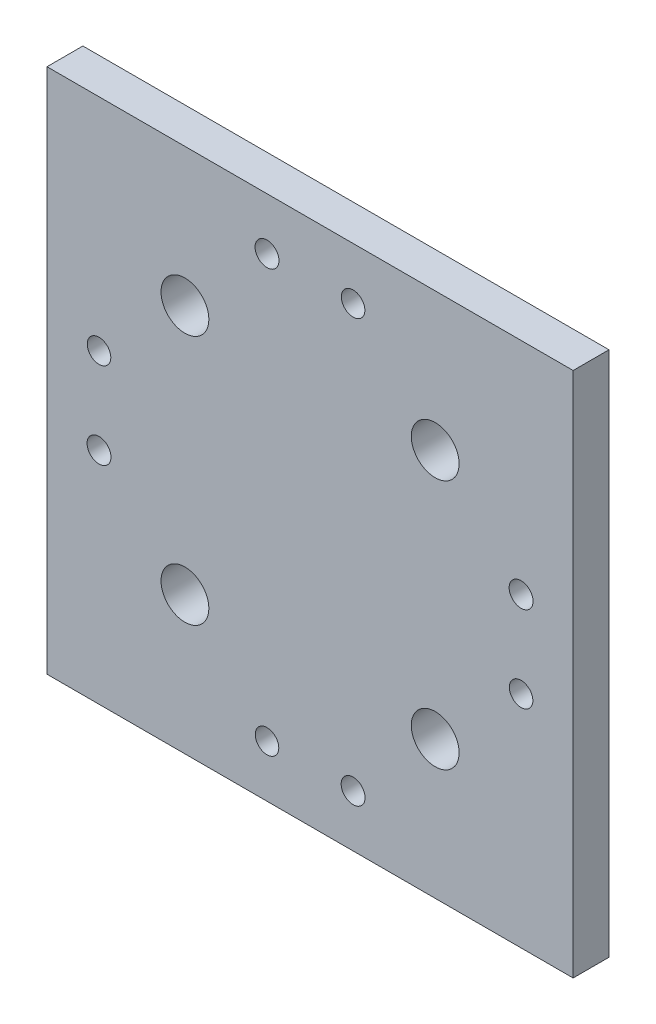
ISO-10303-21;
HEADER;
FILE_DESCRIPTION(('STEP AP214'),'2;1');
FILE_NAME('part.step','',(''),(''),'','','');
FILE_SCHEMA(('AUTOMOTIVE_DESIGN { 1 0 10303 214 1 1 1 1 }'));
ENDSEC;
DATA;
#1=APPLICATION_CONTEXT('core data for automotive mechanical design processes');
#2=APPLICATION_PROTOCOL_DEFINITION('international standard','automotive_design',2000,#1);
#3=PRODUCT_CONTEXT('',#1,'mechanical');
#4=PRODUCT('Part','Part','',(#3));
#5=PRODUCT_RELATED_PRODUCT_CATEGORY('part','',(#4));
#6=PRODUCT_DEFINITION_FORMATION('','',#4);
#7=PRODUCT_DEFINITION_CONTEXT('part definition',#1,'design');
#8=PRODUCT_DEFINITION('design','',#6,#7);
#9=PRODUCT_DEFINITION_SHAPE('','',#8);
#10=(LENGTH_UNIT() NAMED_UNIT(*) SI_UNIT(.MILLI.,.METRE.));
#11=(NAMED_UNIT(*) PLANE_ANGLE_UNIT() SI_UNIT($,.RADIAN.));
#12=(NAMED_UNIT(*) SI_UNIT($,.STERADIAN.) SOLID_ANGLE_UNIT());
#13=UNCERTAINTY_MEASURE_WITH_UNIT(LENGTH_MEASURE(1.E-05),#10,'distance_accuracy_value','');
#14=(GEOMETRIC_REPRESENTATION_CONTEXT(3) GLOBAL_UNCERTAINTY_ASSIGNED_CONTEXT((#13)) GLOBAL_UNIT_ASSIGNED_CONTEXT((#10,
#11,#12)) REPRESENTATION_CONTEXT('',''));
#15=CARTESIAN_POINT('',(0.,0.,0.));
#16=DIRECTION('',(0.,0.,1.));
#17=DIRECTION('',(1.,0.,0.));
#18=AXIS2_PLACEMENT_3D('',#15,#16,#17);
#19=CARTESIAN_POINT('',(69.85,69.85,0.));
#20=DIRECTION('',(0.,0.,-1.));
#21=DIRECTION('',(-1.,0.,0.));
#22=AXIS2_PLACEMENT_3D('',#19,#20,#21);
#23=PLANE('',#22);
#24=CARTESIAN_POINT('',(-11.4300000000006,56.0323999999999,0.));
#25=DIRECTION('',(0.,0.,-1.));
#26=DIRECTION('',(-1.,0.,0.));
#27=AXIS2_PLACEMENT_3D('',#24,#25,#26);
#28=CIRCLE('',#27,3.17499999999999);
#29=CARTESIAN_POINT('',(-14.6050000000006,56.0323999999999,0.));
#30=VERTEX_POINT('',#29);
#31=EDGE_CURVE('E195',#30,#30,#28,.T.);
#32=ORIENTED_EDGE('',*,*,#31,.F.);
#33=EDGE_LOOP('',(#32));
#34=FACE_BOUND('',#33,.T.);
#35=CARTESIAN_POINT('',(56.0323999999999,11.4300000000004,0.));
#36=DIRECTION('',(0.,0.,-1.));
#37=DIRECTION('',(-1.,0.,0.));
#38=AXIS2_PLACEMENT_3D('',#35,#36,#37);
#39=CIRCLE('',#38,3.17499999999999);
#40=CARTESIAN_POINT('',(52.8573999999999,11.4300000000004,0.));
#41=VERTEX_POINT('',#40);
#42=EDGE_CURVE('E189',#41,#41,#39,.T.);
#43=ORIENTED_EDGE('',*,*,#42,.F.);
#44=EDGE_LOOP('',(#43));
#45=FACE_BOUND('',#44,.T.);
#46=CARTESIAN_POINT('',(11.4300000000002,-56.0324,0.));
#47=DIRECTION('',(0.,0.,-1.));
#48=DIRECTION('',(-1.,0.,0.));
#49=AXIS2_PLACEMENT_3D('',#46,#47,#48);
#50=CIRCLE('',#49,3.17499999999999);
#51=CARTESIAN_POINT('',(8.25500000000021,-56.0324,0.));
#52=VERTEX_POINT('',#51);
#53=EDGE_CURVE('E183',#52,#52,#50,.T.);
#54=ORIENTED_EDGE('',*,*,#53,.F.);
#55=EDGE_LOOP('',(#54));
#56=FACE_BOUND('',#55,.T.);
#57=CARTESIAN_POINT('',(11.4299999999994,56.0324000000001,0.));
#58=DIRECTION('',(0.,0.,-1.));
#59=DIRECTION('',(-1.,0.,0.));
#60=AXIS2_PLACEMENT_3D('',#57,#58,#59);
#61=CIRCLE('',#60,3.12419999999999);
#62=CARTESIAN_POINT('',(8.30579999999941,56.0324000000001,0.));
#63=VERTEX_POINT('',#62);
#64=EDGE_CURVE('E177',#63,#63,#61,.T.);
#65=ORIENTED_EDGE('',*,*,#64,.F.);
#66=EDGE_LOOP('',(#65));
#67=FACE_BOUND('',#66,.T.);
#68=CARTESIAN_POINT('',(56.0324000000001,-11.4299999999996,0.));
#69=DIRECTION('',(0.,0.,-1.));
#70=DIRECTION('',(-1.,0.,0.));
#71=AXIS2_PLACEMENT_3D('',#68,#69,#70);
#72=CIRCLE('',#71,3.12419999999999);
#73=CARTESIAN_POINT('',(52.9082000000001,-11.4299999999996,0.));
#74=VERTEX_POINT('',#73);
#75=EDGE_CURVE('E171',#74,#74,#72,.T.);
#76=ORIENTED_EDGE('',*,*,#75,.F.);
#77=EDGE_LOOP('',(#76));
#78=FACE_BOUND('',#77,.T.);
#79=CARTESIAN_POINT('',(-11.4299999999998,-56.0324,0.));
#80=DIRECTION('',(0.,0.,-1.));
#81=DIRECTION('',(-1.,0.,0.));
#82=AXIS2_PLACEMENT_3D('',#79,#80,#81);
#83=CIRCLE('',#82,3.12419999999999);
#84=CARTESIAN_POINT('',(-14.5541999999998,-56.0324,0.));
#85=VERTEX_POINT('',#84);
#86=EDGE_CURVE('E165',#85,#85,#83,.T.);
#87=ORIENTED_EDGE('',*,*,#86,.F.);
#88=EDGE_LOOP('',(#87));
#89=FACE_BOUND('',#88,.T.);
#90=DIRECTION('',(0.,1.,0.));
#91=VECTOR('',#90,1.);
#92=CARTESIAN_POINT('',(69.85,-69.85,0.));
#93=LINE('',#92,#91);
#94=CARTESIAN_POINT('',(69.85,-69.85,0.));
#95=VERTEX_POINT('',#94);
#96=CARTESIAN_POINT('',(69.85,69.85,0.));
#97=VERTEX_POINT('',#96);
#98=EDGE_CURVE('E100',#95,#97,#93,.T.);
#99=ORIENTED_EDGE('',*,*,#98,.F.);
#100=DIRECTION('',(1.,0.,0.));
#101=VECTOR('',#100,1.);
#102=CARTESIAN_POINT('',(-69.85,-69.85,0.));
#103=LINE('',#102,#101);
#104=CARTESIAN_POINT('',(-69.85,-69.85,0.));
#105=VERTEX_POINT('',#104);
#106=EDGE_CURVE('E74',#105,#95,#103,.T.);
#107=ORIENTED_EDGE('',*,*,#106,.F.);
#108=DIRECTION('',(0.,-1.,0.));
#109=VECTOR('',#108,1.);
#110=CARTESIAN_POINT('',(-69.85,-69.85,0.));
#111=LINE('',#110,#109);
#112=CARTESIAN_POINT('',(-69.85,69.85,0.));
#113=VERTEX_POINT('',#112);
#114=EDGE_CURVE('E68',#113,#105,#111,.T.);
#115=ORIENTED_EDGE('',*,*,#114,.F.);
#116=DIRECTION('',(-1.,0.,0.));
#117=VECTOR('',#116,1.);
#118=CARTESIAN_POINT('',(-69.85,69.85,0.));
#119=LINE('',#118,#117);
#120=EDGE_CURVE('E91',#97,#113,#119,.T.);
#121=ORIENTED_EDGE('',*,*,#120,.F.);
#122=EDGE_LOOP('',(#99,#107,#115,#121));
#123=FACE_BOUND('',#122,.T.);
#124=CARTESIAN_POINT('',(-33.2269476479559,33.2269476479559,0.));
#125=DIRECTION('',(0.,0.,1.));
#126=DIRECTION('',(1.,0.,0.));
#127=AXIS2_PLACEMENT_3D('',#124,#125,#126);
#128=CIRCLE('',#127,6.34999999999999);
#129=CARTESIAN_POINT('',(-26.8769476479559,33.2269476479559,0.));
#130=VERTEX_POINT('',#129);
#131=EDGE_CURVE('E103',#130,#130,#128,.T.);
#132=ORIENTED_EDGE('',*,*,#131,.T.);
#133=EDGE_LOOP('',(#132));
#134=FACE_BOUND('',#133,.T.);
#135=CARTESIAN_POINT('',(-56.0324,11.43,0.));
#136=DIRECTION('',(0.,0.,-1.));
#137=DIRECTION('',(-1.,0.,0.));
#138=AXIS2_PLACEMENT_3D('',#135,#136,#137);
#139=CIRCLE('',#138,3.12419999999999);
#140=CARTESIAN_POINT('',(-59.1566,11.43,0.));
#141=VERTEX_POINT('',#140);
#142=EDGE_CURVE('E108',#141,#141,#139,.T.);
#143=ORIENTED_EDGE('',*,*,#142,.F.);
#144=EDGE_LOOP('',(#143));
#145=FACE_BOUND('',#144,.T.);
#146=CARTESIAN_POINT('',(-56.0324,-11.43,0.));
#147=DIRECTION('',(0.,0.,-1.));
#148=DIRECTION('',(-1.,0.,0.));
#149=AXIS2_PLACEMENT_3D('',#146,#147,#148);
#150=CIRCLE('',#149,3.17499999999999);
#151=CARTESIAN_POINT('',(-59.2074,-11.43,0.));
#152=VERTEX_POINT('',#151);
#153=EDGE_CURVE('E36',#152,#152,#150,.T.);
#154=ORIENTED_EDGE('',*,*,#153,.F.);
#155=EDGE_LOOP('',(#154));
#156=FACE_BOUND('',#155,.T.);
#157=CARTESIAN_POINT('',(-33.2269476479558,-33.226947647956,0.));
#158=DIRECTION('',(0.,0.,1.));
#159=DIRECTION('',(1.,0.,0.));
#160=AXIS2_PLACEMENT_3D('',#157,#158,#159);
#161=CIRCLE('',#160,6.34999999999999);
#162=CARTESIAN_POINT('',(-26.8769476479558,-33.226947647956,0.));
#163=VERTEX_POINT('',#162);
#164=EDGE_CURVE('E149',#163,#163,#161,.T.);
#165=ORIENTED_EDGE('',*,*,#164,.T.);
#166=EDGE_LOOP('',(#165));
#167=FACE_BOUND('',#166,.T.);
#168=CARTESIAN_POINT('',(33.2269476479561,-33.2269476479556,0.));
#169=DIRECTION('',(0.,0.,1.));
#170=DIRECTION('',(1.,0.,0.));
#171=AXIS2_PLACEMENT_3D('',#168,#169,#170);
#172=CIRCLE('',#171,6.34999999999999);
#173=CARTESIAN_POINT('',(39.5769476479561,-33.2269476479556,0.));
#174=VERTEX_POINT('',#173);
#175=EDGE_CURVE('E150',#174,#174,#172,.T.);
#176=ORIENTED_EDGE('',*,*,#175,.T.);
#177=EDGE_LOOP('',(#176));
#178=FACE_BOUND('',#177,.T.);
#179=CARTESIAN_POINT('',(33.2269476479555,33.2269476479562,0.));
#180=DIRECTION('',(0.,0.,1.));
#181=DIRECTION('',(1.,0.,0.));
#182=AXIS2_PLACEMENT_3D('',#179,#180,#181);
#183=CIRCLE('',#182,6.34999999999999);
#184=CARTESIAN_POINT('',(39.5769476479555,33.2269476479562,0.));
#185=VERTEX_POINT('',#184);
#186=EDGE_CURVE('E159',#185,#185,#183,.T.);
#187=ORIENTED_EDGE('',*,*,#186,.T.);
#188=EDGE_LOOP('',(#187));
#189=FACE_BOUND('',#188,.T.);
#190=ADVANCED_FACE('F32',(#34,#45,#56,#67,#78,#89,#123,#134,#145,#156,#167,#178,#189),#23,.T.);
#191=CARTESIAN_POINT('',(69.85,69.85,9.525));
#192=DIRECTION('',(0.,0.,-1.));
#193=DIRECTION('',(-1.,0.,0.));
#194=AXIS2_PLACEMENT_3D('',#191,#192,#193);
#195=PLANE('',#194);
#196=CARTESIAN_POINT('',(-11.4300000000006,56.0323999999999,9.525));
#197=DIRECTION('',(0.,0.,1.));
#198=DIRECTION('',(1.,0.,0.));
#199=AXIS2_PLACEMENT_3D('',#196,#197,#198);
#200=CIRCLE('',#199,3.175);
#201=CARTESIAN_POINT('',(-8.2550000000006,56.0323999999999,9.525));
#202=VERTEX_POINT('',#201);
#203=EDGE_CURVE('E198',#202,#202,#200,.T.);
#204=ORIENTED_EDGE('',*,*,#203,.F.);
#205=EDGE_LOOP('',(#204));
#206=FACE_BOUND('',#205,.T.);
#207=CARTESIAN_POINT('',(56.0323999999999,11.4300000000004,9.525));
#208=DIRECTION('',(0.,0.,1.));
#209=DIRECTION('',(1.,0.,0.));
#210=AXIS2_PLACEMENT_3D('',#207,#208,#209);
#211=CIRCLE('',#210,3.175);
#212=CARTESIAN_POINT('',(59.2073999999999,11.4300000000004,9.525));
#213=VERTEX_POINT('',#212);
#214=EDGE_CURVE('E192',#213,#213,#211,.T.);
#215=ORIENTED_EDGE('',*,*,#214,.F.);
#216=EDGE_LOOP('',(#215));
#217=FACE_BOUND('',#216,.T.);
#218=CARTESIAN_POINT('',(11.4300000000002,-56.0324,9.525));
#219=DIRECTION('',(0.,0.,1.));
#220=DIRECTION('',(1.,0.,0.));
#221=AXIS2_PLACEMENT_3D('',#218,#219,#220);
#222=CIRCLE('',#221,3.175);
#223=CARTESIAN_POINT('',(14.6050000000002,-56.0324,9.525));
#224=VERTEX_POINT('',#223);
#225=EDGE_CURVE('E186',#224,#224,#222,.T.);
#226=ORIENTED_EDGE('',*,*,#225,.F.);
#227=EDGE_LOOP('',(#226));
#228=FACE_BOUND('',#227,.T.);
#229=CARTESIAN_POINT('',(11.4299999999994,56.0324000000001,9.525));
#230=DIRECTION('',(0.,0.,1.));
#231=DIRECTION('',(1.,0.,0.));
#232=AXIS2_PLACEMENT_3D('',#229,#230,#231);
#233=CIRCLE('',#232,3.1242);
#234=CARTESIAN_POINT('',(14.5541999999994,56.0324000000001,9.525));
#235=VERTEX_POINT('',#234);
#236=EDGE_CURVE('E180',#235,#235,#233,.T.);
#237=ORIENTED_EDGE('',*,*,#236,.F.);
#238=EDGE_LOOP('',(#237));
#239=FACE_BOUND('',#238,.T.);
#240=CARTESIAN_POINT('',(56.0324000000001,-11.4299999999996,9.525));
#241=DIRECTION('',(0.,0.,1.));
#242=DIRECTION('',(1.,0.,0.));
#243=AXIS2_PLACEMENT_3D('',#240,#241,#242);
#244=CIRCLE('',#243,3.12419999999999);
#245=CARTESIAN_POINT('',(59.1566000000001,-11.4299999999996,9.525));
#246=VERTEX_POINT('',#245);
#247=EDGE_CURVE('E174',#246,#246,#244,.T.);
#248=ORIENTED_EDGE('',*,*,#247,.F.);
#249=EDGE_LOOP('',(#248));
#250=FACE_BOUND('',#249,.T.);
#251=CARTESIAN_POINT('',(-11.4299999999998,-56.0324,9.525));
#252=DIRECTION('',(0.,0.,1.));
#253=DIRECTION('',(1.,0.,0.));
#254=AXIS2_PLACEMENT_3D('',#251,#252,#253);
#255=CIRCLE('',#254,3.1242);
#256=CARTESIAN_POINT('',(-8.3057999999998,-56.0324,9.525));
#257=VERTEX_POINT('',#256);
#258=EDGE_CURVE('E168',#257,#257,#255,.T.);
#259=ORIENTED_EDGE('',*,*,#258,.F.);
#260=EDGE_LOOP('',(#259));
#261=FACE_BOUND('',#260,.T.);
#262=CARTESIAN_POINT('',(33.2269476479555,33.2269476479562,9.525));
#263=DIRECTION('',(0.,0.,1.));
#264=DIRECTION('',(1.,0.,0.));
#265=AXIS2_PLACEMENT_3D('',#262,#263,#264);
#266=CIRCLE('',#265,6.34999999999999);
#267=CARTESIAN_POINT('',(39.5769476479555,33.2269476479562,9.525));
#268=VERTEX_POINT('',#267);
#269=EDGE_CURVE('E162',#268,#268,#266,.T.);
#270=ORIENTED_EDGE('',*,*,#269,.F.);
#271=EDGE_LOOP('',(#270));
#272=FACE_BOUND('',#271,.T.);
#273=CARTESIAN_POINT('',(33.2269476479561,-33.2269476479556,9.525));
#274=DIRECTION('',(0.,0.,1.));
#275=DIRECTION('',(1.,0.,0.));
#276=AXIS2_PLACEMENT_3D('',#273,#274,#275);
#277=CIRCLE('',#276,6.34999999999999);
#278=CARTESIAN_POINT('',(39.5769476479561,-33.2269476479556,9.525));
#279=VERTEX_POINT('',#278);
#280=EDGE_CURVE('E154',#279,#279,#277,.T.);
#281=ORIENTED_EDGE('',*,*,#280,.F.);
#282=EDGE_LOOP('',(#281));
#283=FACE_BOUND('',#282,.T.);
#284=DIRECTION('',(0.,1.,0.));
#285=VECTOR('',#284,1.);
#286=CARTESIAN_POINT('',(69.85,-69.85,9.525));
#287=LINE('',#286,#285);
#288=CARTESIAN_POINT('',(69.85,-69.85,9.525));
#289=VERTEX_POINT('',#288);
#290=CARTESIAN_POINT('',(69.85,69.85,9.525));
#291=VERTEX_POINT('',#290);
#292=EDGE_CURVE('E87',#289,#291,#287,.T.);
#293=ORIENTED_EDGE('',*,*,#292,.T.);
#294=DIRECTION('',(-1.,0.,0.));
#295=VECTOR('',#294,1.);
#296=CARTESIAN_POINT('',(-69.85,69.85,9.525));
#297=LINE('',#296,#295);
#298=CARTESIAN_POINT('',(-69.85,69.85,9.525));
#299=VERTEX_POINT('',#298);
#300=EDGE_CURVE('E81',#291,#299,#297,.T.);
#301=ORIENTED_EDGE('',*,*,#300,.T.);
#302=DIRECTION('',(0.,-1.,0.));
#303=VECTOR('',#302,1.);
#304=CARTESIAN_POINT('',(-69.85,-69.85,9.525));
#305=LINE('',#304,#303);
#306=CARTESIAN_POINT('',(-69.85,-69.85,9.525));
#307=VERTEX_POINT('',#306);
#308=EDGE_CURVE('E85',#299,#307,#305,.T.);
#309=ORIENTED_EDGE('',*,*,#308,.T.);
#310=DIRECTION('',(1.,0.,0.));
#311=VECTOR('',#310,1.);
#312=CARTESIAN_POINT('',(-69.85,-69.85,9.525));
#313=LINE('',#312,#311);
#314=EDGE_CURVE('E51',#307,#289,#313,.T.);
#315=ORIENTED_EDGE('',*,*,#314,.T.);
#316=EDGE_LOOP('',(#293,#301,#309,#315));
#317=FACE_BOUND('',#316,.T.);
#318=CARTESIAN_POINT('',(-33.2269476479559,33.2269476479559,9.525));
#319=DIRECTION('',(0.,0.,1.));
#320=DIRECTION('',(1.,0.,0.));
#321=AXIS2_PLACEMENT_3D('',#318,#319,#320);
#322=CIRCLE('',#321,6.34999999999999);
#323=CARTESIAN_POINT('',(-26.8769476479559,33.2269476479559,9.525));
#324=VERTEX_POINT('',#323);
#325=EDGE_CURVE('E110',#324,#324,#322,.T.);
#326=ORIENTED_EDGE('',*,*,#325,.F.);
#327=EDGE_LOOP('',(#326));
#328=FACE_BOUND('',#327,.T.);
#329=CARTESIAN_POINT('',(-56.0324,11.43,9.525));
#330=DIRECTION('',(0.,0.,1.));
#331=DIRECTION('',(1.,0.,0.));
#332=AXIS2_PLACEMENT_3D('',#329,#330,#331);
#333=CIRCLE('',#332,3.12419999999999);
#334=CARTESIAN_POINT('',(-52.9082,11.43,9.525));
#335=VERTEX_POINT('',#334);
#336=EDGE_CURVE('E111',#335,#335,#333,.T.);
#337=ORIENTED_EDGE('',*,*,#336,.F.);
#338=EDGE_LOOP('',(#337));
#339=FACE_BOUND('',#338,.T.);
#340=CARTESIAN_POINT('',(-56.0324,-11.43,9.525));
#341=DIRECTION('',(0.,0.,1.));
#342=DIRECTION('',(1.,0.,0.));
#343=AXIS2_PLACEMENT_3D('',#340,#341,#342);
#344=CIRCLE('',#343,3.175);
#345=CARTESIAN_POINT('',(-52.8574,-11.43,9.525));
#346=VERTEX_POINT('',#345);
#347=EDGE_CURVE('E121',#346,#346,#344,.T.);
#348=ORIENTED_EDGE('',*,*,#347,.F.);
#349=EDGE_LOOP('',(#348));
#350=FACE_BOUND('',#349,.T.);
#351=CARTESIAN_POINT('',(-33.2269476479558,-33.226947647956,9.525));
#352=DIRECTION('',(0.,0.,1.));
#353=DIRECTION('',(1.,0.,0.));
#354=AXIS2_PLACEMENT_3D('',#351,#352,#353);
#355=CIRCLE('',#354,6.34999999999999);
#356=CARTESIAN_POINT('',(-26.8769476479558,-33.226947647956,9.525));
#357=VERTEX_POINT('',#356);
#358=EDGE_CURVE('E147',#357,#357,#355,.T.);
#359=ORIENTED_EDGE('',*,*,#358,.F.);
#360=EDGE_LOOP('',(#359));
#361=FACE_BOUND('',#360,.T.);
#362=ADVANCED_FACE('F82',(#206,#217,#228,#239,#250,#261,#272,#283,#317,#328,#339,#350,#361),
#195,.F.);
#363=CARTESIAN_POINT('',(69.85,-69.85,9.525));
#364=DIRECTION('',(-1.,0.,0.));
#365=DIRECTION('',(0.,0.,1.));
#366=AXIS2_PLACEMENT_3D('',#363,#364,#365);
#367=PLANE('',#366);
#368=ORIENTED_EDGE('',*,*,#98,.T.);
#369=DIRECTION('',(0.,0.,-1.));
#370=VECTOR('',#369,1.);
#371=CARTESIAN_POINT('',(69.85,69.85,9.525));
#372=LINE('',#371,#370);
#373=EDGE_CURVE('E11',#291,#97,#372,.T.);
#374=ORIENTED_EDGE('',*,*,#373,.F.);
#375=ORIENTED_EDGE('',*,*,#292,.F.);
#376=DIRECTION('',(0.,0.,-1.));
#377=VECTOR('',#376,1.);
#378=CARTESIAN_POINT('',(69.85,-69.85,9.525));
#379=LINE('',#378,#377);
#380=EDGE_CURVE('E96',#289,#95,#379,.T.);
#381=ORIENTED_EDGE('',*,*,#380,.T.);
#382=EDGE_LOOP('',(#368,#374,#375,#381));
#383=FACE_BOUND('',#382,.T.);
#384=ADVANCED_FACE('F34',(#383),#367,.F.);
#385=CARTESIAN_POINT('',(-69.85,69.85,9.525));
#386=DIRECTION('',(0.,-1.,0.));
#387=DIRECTION('',(0.,0.,-1.));
#388=AXIS2_PLACEMENT_3D('',#385,#386,#387);
#389=PLANE('',#388);
#390=ORIENTED_EDGE('',*,*,#120,.T.);
#391=DIRECTION('',(0.,0.,-1.));
#392=VECTOR('',#391,1.);
#393=CARTESIAN_POINT('',(-69.85,69.85,9.525));
#394=LINE('',#393,#392);
#395=EDGE_CURVE('E42',#299,#113,#394,.T.);
#396=ORIENTED_EDGE('',*,*,#395,.F.);
#397=ORIENTED_EDGE('',*,*,#300,.F.);
#398=ORIENTED_EDGE('',*,*,#373,.T.);
#399=EDGE_LOOP('',(#390,#396,#397,#398));
#400=FACE_BOUND('',#399,.T.);
#401=ADVANCED_FACE('F90',(#400),#389,.F.);
#402=CARTESIAN_POINT('',(-69.85,-69.85,9.525));
#403=DIRECTION('',(1.,0.,0.));
#404=DIRECTION('',(0.,0.,-1.));
#405=AXIS2_PLACEMENT_3D('',#402,#403,#404);
#406=PLANE('',#405);
#407=ORIENTED_EDGE('',*,*,#114,.T.);
#408=DIRECTION('',(0.,0.,-1.));
#409=VECTOR('',#408,1.);
#410=CARTESIAN_POINT('',(-69.85,-69.85,9.525));
#411=LINE('',#410,#409);
#412=EDGE_CURVE('E92',#307,#105,#411,.T.);
#413=ORIENTED_EDGE('',*,*,#412,.F.);
#414=ORIENTED_EDGE('',*,*,#308,.F.);
#415=ORIENTED_EDGE('',*,*,#395,.T.);
#416=EDGE_LOOP('',(#407,#413,#414,#415));
#417=FACE_BOUND('',#416,.T.);
#418=ADVANCED_FACE('F94',(#417),#406,.F.);
#419=CARTESIAN_POINT('',(-69.85,-69.85,9.525));
#420=DIRECTION('',(0.,1.,0.));
#421=DIRECTION('',(0.,0.,1.));
#422=AXIS2_PLACEMENT_3D('',#419,#420,#421);
#423=PLANE('',#422);
#424=ORIENTED_EDGE('',*,*,#106,.T.);
#425=ORIENTED_EDGE('',*,*,#380,.F.);
#426=ORIENTED_EDGE('',*,*,#314,.F.);
#427=ORIENTED_EDGE('',*,*,#412,.T.);
#428=EDGE_LOOP('',(#424,#425,#426,#427));
#429=FACE_BOUND('',#428,.T.);
#430=ADVANCED_FACE('F134',(#429),#423,.F.);
#431=CARTESIAN_POINT('',(-33.2269476479559,33.2269476479559,9.525));
#432=DIRECTION('',(0.,0.,1.));
#433=DIRECTION('',(1.,0.,0.));
#434=AXIS2_PLACEMENT_3D('',#431,#432,#433);
#435=CYLINDRICAL_SURFACE('',#434,6.34999999999999);
#436=ORIENTED_EDGE('',*,*,#131,.F.);
#437=EDGE_LOOP('',(#436));
#438=FACE_BOUND('',#437,.T.);
#439=ORIENTED_EDGE('',*,*,#325,.T.);
#440=EDGE_LOOP('',(#439));
#441=FACE_BOUND('',#440,.T.);
#442=ADVANCED_FACE('F130',(#438,#441),#435,.F.);
#443=CARTESIAN_POINT('',(-56.0324,11.43,9.525));
#444=DIRECTION('',(0.,0.,1.));
#445=DIRECTION('',(1.,0.,0.));
#446=AXIS2_PLACEMENT_3D('',#443,#444,#445);
#447=CYLINDRICAL_SURFACE('',#446,3.12419999999999);
#448=ORIENTED_EDGE('',*,*,#142,.T.);
#449=EDGE_LOOP('',(#448));
#450=FACE_BOUND('',#449,.T.);
#451=ORIENTED_EDGE('',*,*,#336,.T.);
#452=EDGE_LOOP('',(#451));
#453=FACE_BOUND('',#452,.T.);
#454=ADVANCED_FACE('F133',(#450,#453),#447,.F.);
#455=CARTESIAN_POINT('',(-56.0324,-11.43,9.525));
#456=DIRECTION('',(0.,0.,1.));
#457=DIRECTION('',(1.,0.,0.));
#458=AXIS2_PLACEMENT_3D('',#455,#456,#457);
#459=CYLINDRICAL_SURFACE('',#458,3.17499999999999);
#460=ORIENTED_EDGE('',*,*,#153,.T.);
#461=EDGE_LOOP('',(#460));
#462=FACE_BOUND('',#461,.T.);
#463=ORIENTED_EDGE('',*,*,#347,.T.);
#464=EDGE_LOOP('',(#463));
#465=FACE_BOUND('',#464,.T.);
#466=ADVANCED_FACE('F231',(#462,#465),#459,.F.);
#467=CARTESIAN_POINT('',(-33.2269476479558,-33.226947647956,9.525));
#468=DIRECTION('',(0.,0.,1.));
#469=DIRECTION('',(1.,0.,0.));
#470=AXIS2_PLACEMENT_3D('',#467,#468,#469);
#471=CYLINDRICAL_SURFACE('',#470,6.34999999999999);
#472=ORIENTED_EDGE('',*,*,#164,.F.);
#473=EDGE_LOOP('',(#472));
#474=FACE_BOUND('',#473,.T.);
#475=ORIENTED_EDGE('',*,*,#358,.T.);
#476=EDGE_LOOP('',(#475));
#477=FACE_BOUND('',#476,.T.);
#478=ADVANCED_FACE('F221',(#474,#477),#471,.F.);
#479=CARTESIAN_POINT('',(33.2269476479561,-33.2269476479556,9.525));
#480=DIRECTION('',(0.,0.,1.));
#481=DIRECTION('',(1.,0.,0.));
#482=AXIS2_PLACEMENT_3D('',#479,#480,#481);
#483=CYLINDRICAL_SURFACE('',#482,6.34999999999999);
#484=ORIENTED_EDGE('',*,*,#175,.F.);
#485=EDGE_LOOP('',(#484));
#486=FACE_BOUND('',#485,.T.);
#487=ORIENTED_EDGE('',*,*,#280,.T.);
#488=EDGE_LOOP('',(#487));
#489=FACE_BOUND('',#488,.T.);
#490=ADVANCED_FACE('F218',(#486,#489),#483,.F.);
#491=CARTESIAN_POINT('',(33.2269476479555,33.2269476479562,9.525));
#492=DIRECTION('',(0.,0.,1.));
#493=DIRECTION('',(1.,0.,0.));
#494=AXIS2_PLACEMENT_3D('',#491,#492,#493);
#495=CYLINDRICAL_SURFACE('',#494,6.34999999999999);
#496=ORIENTED_EDGE('',*,*,#186,.F.);
#497=EDGE_LOOP('',(#496));
#498=FACE_BOUND('',#497,.T.);
#499=ORIENTED_EDGE('',*,*,#269,.T.);
#500=EDGE_LOOP('',(#499));
#501=FACE_BOUND('',#500,.T.);
#502=ADVANCED_FACE('F220',(#498,#501),#495,.F.);
#503=CARTESIAN_POINT('',(-11.4299999999998,-56.0324,9.525));
#504=DIRECTION('',(0.,0.,1.));
#505=DIRECTION('',(1.,0.,0.));
#506=AXIS2_PLACEMENT_3D('',#503,#504,#505);
#507=CYLINDRICAL_SURFACE('',#506,3.12419999999999);
#508=ORIENTED_EDGE('',*,*,#86,.T.);
#509=EDGE_LOOP('',(#508));
#510=FACE_BOUND('',#509,.T.);
#511=ORIENTED_EDGE('',*,*,#258,.T.);
#512=EDGE_LOOP('',(#511));
#513=FACE_BOUND('',#512,.T.);
#514=ADVANCED_FACE('F228',(#510,#513),#507,.F.);
#515=CARTESIAN_POINT('',(56.0324000000001,-11.4299999999996,9.525));
#516=DIRECTION('',(0.,0.,1.));
#517=DIRECTION('',(1.,0.,0.));
#518=AXIS2_PLACEMENT_3D('',#515,#516,#517);
#519=CYLINDRICAL_SURFACE('',#518,3.12419999999999);
#520=ORIENTED_EDGE('',*,*,#75,.T.);
#521=EDGE_LOOP('',(#520));
#522=FACE_BOUND('',#521,.T.);
#523=ORIENTED_EDGE('',*,*,#247,.T.);
#524=EDGE_LOOP('',(#523));
#525=FACE_BOUND('',#524,.T.);
#526=ADVANCED_FACE('F289',(#522,#525),#519,.F.);
#527=CARTESIAN_POINT('',(11.4299999999994,56.0324000000001,9.525));
#528=DIRECTION('',(0.,0.,1.));
#529=DIRECTION('',(1.,0.,0.));
#530=AXIS2_PLACEMENT_3D('',#527,#528,#529);
#531=CYLINDRICAL_SURFACE('',#530,3.12419999999999);
#532=ORIENTED_EDGE('',*,*,#64,.T.);
#533=EDGE_LOOP('',(#532));
#534=FACE_BOUND('',#533,.T.);
#535=ORIENTED_EDGE('',*,*,#236,.T.);
#536=EDGE_LOOP('',(#535));
#537=FACE_BOUND('',#536,.T.);
#538=ADVANCED_FACE('F299',(#534,#537),#531,.F.);
#539=CARTESIAN_POINT('',(11.4300000000002,-56.0324,9.525));
#540=DIRECTION('',(0.,0.,1.));
#541=DIRECTION('',(1.,0.,0.));
#542=AXIS2_PLACEMENT_3D('',#539,#540,#541);
#543=CYLINDRICAL_SURFACE('',#542,3.17499999999999);
#544=ORIENTED_EDGE('',*,*,#53,.T.);
#545=EDGE_LOOP('',(#544));
#546=FACE_BOUND('',#545,.T.);
#547=ORIENTED_EDGE('',*,*,#225,.T.);
#548=EDGE_LOOP('',(#547));
#549=FACE_BOUND('',#548,.T.);
#550=ADVANCED_FACE('F309',(#546,#549),#543,.F.);
#551=CARTESIAN_POINT('',(56.0323999999999,11.4300000000004,9.525));
#552=DIRECTION('',(0.,0.,1.));
#553=DIRECTION('',(1.,0.,0.));
#554=AXIS2_PLACEMENT_3D('',#551,#552,#553);
#555=CYLINDRICAL_SURFACE('',#554,3.17499999999999);
#556=ORIENTED_EDGE('',*,*,#42,.T.);
#557=EDGE_LOOP('',(#556));
#558=FACE_BOUND('',#557,.T.);
#559=ORIENTED_EDGE('',*,*,#214,.T.);
#560=EDGE_LOOP('',(#559));
#561=FACE_BOUND('',#560,.T.);
#562=ADVANCED_FACE('F319',(#558,#561),#555,.F.);
#563=CARTESIAN_POINT('',(-11.4300000000006,56.0323999999999,9.525));
#564=DIRECTION('',(0.,0.,1.));
#565=DIRECTION('',(1.,0.,0.));
#566=AXIS2_PLACEMENT_3D('',#563,#564,#565);
#567=CYLINDRICAL_SURFACE('',#566,3.17499999999999);
#568=ORIENTED_EDGE('',*,*,#31,.T.);
#569=EDGE_LOOP('',(#568));
#570=FACE_BOUND('',#569,.T.);
#571=ORIENTED_EDGE('',*,*,#203,.T.);
#572=EDGE_LOOP('',(#571));
#573=FACE_BOUND('',#572,.T.);
#574=ADVANCED_FACE('F202',(#570,#573),#567,.F.);
#575=CLOSED_SHELL('',(#190,#362,#384,#401,#418,#430,#442,#454,#466,#478,#490,#502,#514,#526,
#538,#550,#562,#574));
#576=MANIFOLD_SOLID_BREP('B2',#575);
#577=ADVANCED_BREP_SHAPE_REPRESENTATION('',(#18,#576),#14);
#578=SHAPE_DEFINITION_REPRESENTATION(#9,#577);
ENDSEC;
END-ISO-10303-21;
